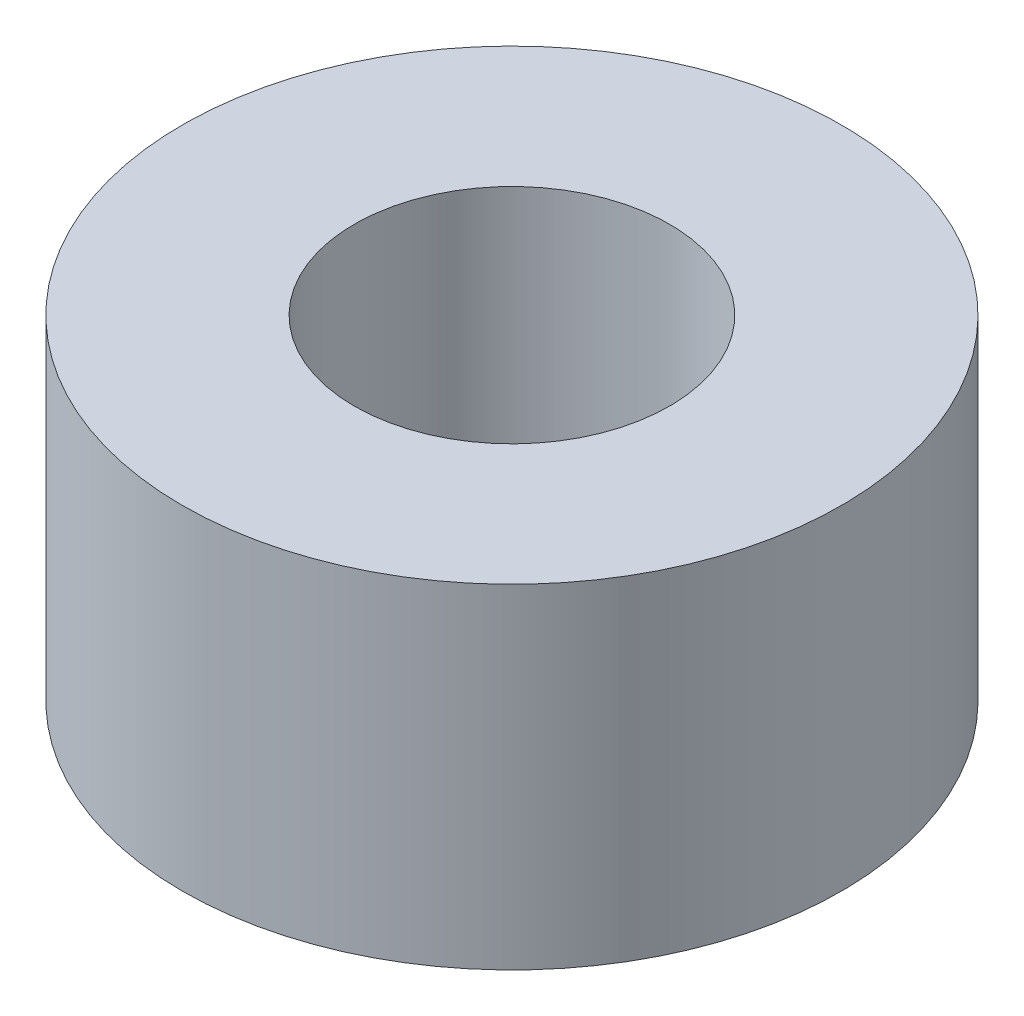
ISO-10303-21;
HEADER;
FILE_DESCRIPTION(('STEP AP214'),'2;1');
FILE_NAME('part.step','',(''),(''),'','','');
FILE_SCHEMA(('AUTOMOTIVE_DESIGN { 1 0 10303 214 1 1 1 1 }'));
ENDSEC;
DATA;
#1=APPLICATION_CONTEXT('core data for automotive mechanical design processes');
#2=APPLICATION_PROTOCOL_DEFINITION('international standard','automotive_design',2000,#1);
#3=PRODUCT_CONTEXT('',#1,'mechanical');
#4=PRODUCT('Part','Part','',(#3));
#5=PRODUCT_RELATED_PRODUCT_CATEGORY('part','',(#4));
#6=PRODUCT_DEFINITION_FORMATION('','',#4);
#7=PRODUCT_DEFINITION_CONTEXT('part definition',#1,'design');
#8=PRODUCT_DEFINITION('design','',#6,#7);
#9=PRODUCT_DEFINITION_SHAPE('','',#8);
#10=(LENGTH_UNIT() NAMED_UNIT(*) SI_UNIT(.MILLI.,.METRE.));
#11=(NAMED_UNIT(*) PLANE_ANGLE_UNIT() SI_UNIT($,.RADIAN.));
#12=(NAMED_UNIT(*) SI_UNIT($,.STERADIAN.) SOLID_ANGLE_UNIT());
#13=UNCERTAINTY_MEASURE_WITH_UNIT(LENGTH_MEASURE(1.E-05),#10,'distance_accuracy_value','');
#14=(GEOMETRIC_REPRESENTATION_CONTEXT(3) GLOBAL_UNCERTAINTY_ASSIGNED_CONTEXT((#13)) GLOBAL_UNIT_ASSIGNED_CONTEXT((#10,
#11,#12)) REPRESENTATION_CONTEXT('',''));
#15=CARTESIAN_POINT('',(0.,0.,0.));
#16=DIRECTION('',(0.,0.,1.));
#17=DIRECTION('',(1.,0.,0.));
#18=AXIS2_PLACEMENT_3D('',#15,#16,#17);
#19=CARTESIAN_POINT('',(0.,15.2036603500531,0.));
#20=DIRECTION('',(0.,-1.,0.));
#21=DIRECTION('',(0.,0.,-1.));
#22=AXIS2_PLACEMENT_3D('',#19,#20,#21);
#23=CYLINDRICAL_SURFACE('',#22,15.);
#24=CARTESIAN_POINT('',(0.,15.2036603500531,0.));
#25=DIRECTION('',(0.,1.,0.));
#26=DIRECTION('',(0.,0.,1.));
#27=AXIS2_PLACEMENT_3D('',#24,#25,#26);
#28=CIRCLE('',#27,15.);
#29=CARTESIAN_POINT('',(0.,15.2036603500531,15.));
#30=VERTEX_POINT('',#29);
#31=EDGE_CURVE('E10',#30,#30,#28,.T.);
#32=ORIENTED_EDGE('',*,*,#31,.F.);
#33=EDGE_LOOP('',(#32));
#34=FACE_BOUND('',#33,.T.);
#35=CARTESIAN_POINT('',(0.,0.,0.));
#36=DIRECTION('',(0.,1.,0.));
#37=DIRECTION('',(0.,0.,1.));
#38=AXIS2_PLACEMENT_3D('',#35,#36,#37);
#39=CIRCLE('',#38,15.);
#40=CARTESIAN_POINT('',(0.,0.,15.));
#41=VERTEX_POINT('',#40);
#42=EDGE_CURVE('E37',#41,#41,#39,.T.);
#43=ORIENTED_EDGE('',*,*,#42,.T.);
#44=EDGE_LOOP('',(#43));
#45=FACE_BOUND('',#44,.T.);
#46=ADVANCED_FACE('F40',(#34,#45),#23,.T.);
#47=CARTESIAN_POINT('',(0.,15.2036603500531,0.));
#48=DIRECTION('',(0.,1.,0.));
#49=DIRECTION('',(0.,0.,1.));
#50=AXIS2_PLACEMENT_3D('',#47,#48,#49);
#51=PLANE('',#50);
#52=CARTESIAN_POINT('',(0.,15.2036603500531,0.));
#53=DIRECTION('',(0.,1.,0.));
#54=DIRECTION('',(0.,0.,1.));
#55=AXIS2_PLACEMENT_3D('',#52,#53,#54);
#56=CIRCLE('',#55,7.17384290346869);
#57=CARTESIAN_POINT('',(0.,15.2036603500531,7.17384290346869));
#58=VERTEX_POINT('',#57);
#59=EDGE_CURVE('E50',#58,#58,#56,.T.);
#60=ORIENTED_EDGE('',*,*,#59,.F.);
#61=EDGE_LOOP('',(#60));
#62=FACE_BOUND('',#61,.T.);
#63=ORIENTED_EDGE('',*,*,#31,.T.);
#64=EDGE_LOOP('',(#63));
#65=FACE_BOUND('',#64,.T.);
#66=ADVANCED_FACE('F59',(#62,#65),#51,.T.);
#67=CARTESIAN_POINT('',(0.,0.,0.));
#68=DIRECTION('',(0.,1.,0.));
#69=DIRECTION('',(0.,0.,1.));
#70=AXIS2_PLACEMENT_3D('',#67,#68,#69);
#71=PLANE('',#70);
#72=CARTESIAN_POINT('',(0.,0.,0.));
#73=DIRECTION('',(0.,1.,0.));
#74=DIRECTION('',(0.,0.,1.));
#75=AXIS2_PLACEMENT_3D('',#72,#73,#74);
#76=CIRCLE('',#75,7.17384290346869);
#77=CARTESIAN_POINT('',(0.,0.,7.17384290346869));
#78=VERTEX_POINT('',#77);
#79=EDGE_CURVE('E47',#78,#78,#76,.T.);
#80=ORIENTED_EDGE('',*,*,#79,.T.);
#81=EDGE_LOOP('',(#80));
#82=FACE_BOUND('',#81,.T.);
#83=ORIENTED_EDGE('',*,*,#42,.F.);
#84=EDGE_LOOP('',(#83));
#85=FACE_BOUND('',#84,.T.);
#86=ADVANCED_FACE('F58',(#82,#85),#71,.F.);
#87=CARTESIAN_POINT('',(0.,15.2036603500531,0.));
#88=DIRECTION('',(0.,-1.,0.));
#89=DIRECTION('',(0.,0.,-1.));
#90=AXIS2_PLACEMENT_3D('',#87,#88,#89);
#91=CYLINDRICAL_SURFACE('',#90,7.17384290346869);
#92=ORIENTED_EDGE('',*,*,#59,.T.);
#93=EDGE_LOOP('',(#92));
#94=FACE_BOUND('',#93,.T.);
#95=ORIENTED_EDGE('',*,*,#79,.F.);
#96=EDGE_LOOP('',(#95));
#97=FACE_BOUND('',#96,.T.);
#98=ADVANCED_FACE('F54',(#94,#97),#91,.F.);
#99=CLOSED_SHELL('',(#46,#66,#86,#98));
#100=MANIFOLD_SOLID_BREP('B2',#99);
#101=ADVANCED_BREP_SHAPE_REPRESENTATION('',(#18,#100),#14);
#102=SHAPE_DEFINITION_REPRESENTATION(#9,#101);
ENDSEC;
END-ISO-10303-21;
